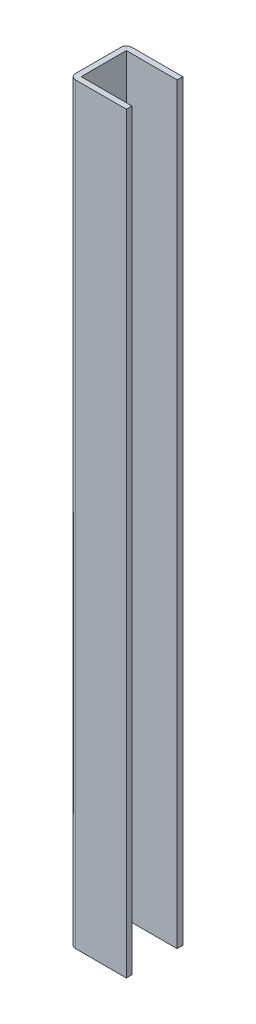
ISO-10303-21;
HEADER;
FILE_DESCRIPTION(('STEP AP214'),'2;1');
FILE_NAME('part.step','',(''),(''),'','','');
FILE_SCHEMA(('AUTOMOTIVE_DESIGN { 1 0 10303 214 1 1 1 1 }'));
ENDSEC;
DATA;
#1=APPLICATION_CONTEXT('core data for automotive mechanical design processes');
#2=APPLICATION_PROTOCOL_DEFINITION('international standard','automotive_design',2000,#1);
#3=PRODUCT_CONTEXT('',#1,'mechanical');
#4=PRODUCT('Part','Part','',(#3));
#5=PRODUCT_RELATED_PRODUCT_CATEGORY('part','',(#4));
#6=PRODUCT_DEFINITION_FORMATION('','',#4);
#7=PRODUCT_DEFINITION_CONTEXT('part definition',#1,'design');
#8=PRODUCT_DEFINITION('design','',#6,#7);
#9=PRODUCT_DEFINITION_SHAPE('','',#8);
#10=(LENGTH_UNIT() NAMED_UNIT(*) SI_UNIT(.MILLI.,.METRE.));
#11=(NAMED_UNIT(*) PLANE_ANGLE_UNIT() SI_UNIT($,.RADIAN.));
#12=(NAMED_UNIT(*) SI_UNIT($,.STERADIAN.) SOLID_ANGLE_UNIT());
#13=UNCERTAINTY_MEASURE_WITH_UNIT(LENGTH_MEASURE(1.E-05),#10,'distance_accuracy_value','');
#14=(GEOMETRIC_REPRESENTATION_CONTEXT(3) GLOBAL_UNCERTAINTY_ASSIGNED_CONTEXT((#13)) GLOBAL_UNIT_ASSIGNED_CONTEXT((#10,
#11,#12)) REPRESENTATION_CONTEXT('',''));
#15=CARTESIAN_POINT('',(0.,0.,0.));
#16=DIRECTION('',(0.,0.,1.));
#17=DIRECTION('',(1.,0.,0.));
#18=AXIS2_PLACEMENT_3D('',#15,#16,#17);
#19=CARTESIAN_POINT('',(-37.,400.,-12.));
#20=DIRECTION('',(0.,1.,0.));
#21=DIRECTION('',(0.,0.,1.));
#22=AXIS2_PLACEMENT_3D('',#19,#20,#21);
#23=PLANE('',#22);
#24=DIRECTION('',(0.,0.,1.));
#25=VECTOR('',#24,1.);
#26=CARTESIAN_POINT('',(-10.,400.,23.0622512959863));
#27=LINE('',#26,#25);
#28=CARTESIAN_POINT('',(-10.,400.,-15.));
#29=VERTEX_POINT('',#28);
#30=CARTESIAN_POINT('',(-10.,400.,-12.));
#31=VERTEX_POINT('',#30);
#32=EDGE_CURVE('E94',#29,#31,#27,.T.);
#33=ORIENTED_EDGE('',*,*,#32,.F.);
#34=DIRECTION('',(-1.,0.,0.));
#35=VECTOR('',#34,1.);
#36=CARTESIAN_POINT('',(-37.,400.,-15.));
#37=LINE('',#36,#35);
#38=CARTESIAN_POINT('',(-37.,400.,-15.));
#39=VERTEX_POINT('',#38);
#40=EDGE_CURVE('E159',#29,#39,#37,.T.);
#41=ORIENTED_EDGE('',*,*,#40,.T.);
#42=CARTESIAN_POINT('',(-37.,400.,-12.));
#43=DIRECTION('',(0.,1.,0.));
#44=DIRECTION('',(0.,0.,1.));
#45=AXIS2_PLACEMENT_3D('',#42,#43,#44);
#46=CIRCLE('',#45,3.);
#47=CARTESIAN_POINT('',(-40.,400.,-12.));
#48=VERTEX_POINT('',#47);
#49=EDGE_CURVE('E190',#39,#48,#46,.T.);
#50=ORIENTED_EDGE('',*,*,#49,.T.);
#51=DIRECTION('',(0.,0.,1.));
#52=VECTOR('',#51,1.);
#53=CARTESIAN_POINT('',(-40.,400.,-12.));
#54=LINE('',#53,#52);
#55=CARTESIAN_POINT('',(-40.,400.,12.));
#56=VERTEX_POINT('',#55);
#57=EDGE_CURVE('E201',#48,#56,#54,.T.);
#58=ORIENTED_EDGE('',*,*,#57,.T.);
#59=CARTESIAN_POINT('',(-37.,400.,12.));
#60=DIRECTION('',(0.,1.,0.));
#61=DIRECTION('',(0.,0.,1.));
#62=AXIS2_PLACEMENT_3D('',#59,#60,#61);
#63=CIRCLE('',#62,3.);
#64=CARTESIAN_POINT('',(-37.,400.,15.));
#65=VERTEX_POINT('',#64);
#66=EDGE_CURVE('E174',#56,#65,#63,.T.);
#67=ORIENTED_EDGE('',*,*,#66,.T.);
#68=DIRECTION('',(1.,0.,0.));
#69=VECTOR('',#68,1.);
#70=CARTESIAN_POINT('',(-37.,400.,15.));
#71=LINE('',#70,#69);
#72=CARTESIAN_POINT('',(-10.,400.,15.));
#73=VERTEX_POINT('',#72);
#74=EDGE_CURVE('E169',#65,#73,#71,.T.);
#75=ORIENTED_EDGE('',*,*,#74,.T.);
#76=CARTESIAN_POINT('',(-10.,400.,12.));
#77=VERTEX_POINT('',#76);
#78=EDGE_CURVE('E163',#77,#73,#27,.T.);
#79=ORIENTED_EDGE('',*,*,#78,.F.);
#80=DIRECTION('',(1.,0.,0.));
#81=VECTOR('',#80,1.);
#82=CARTESIAN_POINT('',(-37.,400.,12.));
#83=LINE('',#82,#81);
#84=CARTESIAN_POINT('',(-37.,400.,12.));
#85=VERTEX_POINT('',#84);
#86=EDGE_CURVE('E237',#85,#77,#83,.T.);
#87=ORIENTED_EDGE('',*,*,#86,.F.);
#88=DIRECTION('',(0.,0.,1.));
#89=VECTOR('',#88,1.);
#90=CARTESIAN_POINT('',(-37.,400.,-12.));
#91=LINE('',#90,#89);
#92=CARTESIAN_POINT('',(-37.,400.,-12.));
#93=VERTEX_POINT('',#92);
#94=EDGE_CURVE('E229',#93,#85,#91,.T.);
#95=ORIENTED_EDGE('',*,*,#94,.F.);
#96=DIRECTION('',(-1.,0.,0.));
#97=VECTOR('',#96,1.);
#98=CARTESIAN_POINT('',(-37.,400.,-12.));
#99=LINE('',#98,#97);
#100=EDGE_CURVE('E162',#31,#93,#99,.T.);
#101=ORIENTED_EDGE('',*,*,#100,.F.);
#102=EDGE_LOOP('',(#33,#41,#50,#58,#67,#75,#79,#87,#95,#101));
#103=FACE_BOUND('',#102,.T.);
#104=ADVANCED_FACE('F72',(#103),#23,.T.);
#105=CARTESIAN_POINT('',(-37.,0.,-12.));
#106=DIRECTION('',(0.,1.,0.));
#107=DIRECTION('',(0.,0.,1.));
#108=AXIS2_PLACEMENT_3D('',#105,#106,#107);
#109=PLANE('',#108);
#110=DIRECTION('',(-1.,0.,0.));
#111=VECTOR('',#110,1.);
#112=CARTESIAN_POINT('',(-37.,0.,-15.));
#113=LINE('',#112,#111);
#114=CARTESIAN_POINT('',(-10.,0.,-15.));
#115=VERTEX_POINT('',#114);
#116=CARTESIAN_POINT('',(-37.,0.,-15.));
#117=VERTEX_POINT('',#116);
#118=EDGE_CURVE('E189',#115,#117,#113,.T.);
#119=ORIENTED_EDGE('',*,*,#118,.F.);
#120=DIRECTION('',(0.,0.,1.));
#121=VECTOR('',#120,1.);
#122=CARTESIAN_POINT('',(-10.,0.,23.0622512959863));
#123=LINE('',#122,#121);
#124=CARTESIAN_POINT('',(-10.,0.,-12.));
#125=VERTEX_POINT('',#124);
#126=EDGE_CURVE('E149',#115,#125,#123,.T.);
#127=ORIENTED_EDGE('',*,*,#126,.T.);
#128=DIRECTION('',(-1.,0.,0.));
#129=VECTOR('',#128,1.);
#130=CARTESIAN_POINT('',(-37.,0.,-12.));
#131=LINE('',#130,#129);
#132=CARTESIAN_POINT('',(-37.,0.,-12.));
#133=VERTEX_POINT('',#132);
#134=EDGE_CURVE('E227',#125,#133,#131,.T.);
#135=ORIENTED_EDGE('',*,*,#134,.T.);
#136=DIRECTION('',(0.,0.,1.));
#137=VECTOR('',#136,1.);
#138=CARTESIAN_POINT('',(-37.,0.,-12.));
#139=LINE('',#138,#137);
#140=CARTESIAN_POINT('',(-37.,0.,12.));
#141=VERTEX_POINT('',#140);
#142=EDGE_CURVE('E233',#133,#141,#139,.T.);
#143=ORIENTED_EDGE('',*,*,#142,.T.);
#144=DIRECTION('',(1.,0.,0.));
#145=VECTOR('',#144,1.);
#146=CARTESIAN_POINT('',(-37.,0.,12.));
#147=LINE('',#146,#145);
#148=CARTESIAN_POINT('',(-10.,0.,12.));
#149=VERTEX_POINT('',#148);
#150=EDGE_CURVE('E230',#141,#149,#147,.T.);
#151=ORIENTED_EDGE('',*,*,#150,.T.);
#152=CARTESIAN_POINT('',(-10.,0.,15.));
#153=VERTEX_POINT('',#152);
#154=EDGE_CURVE('E87',#149,#153,#123,.T.);
#155=ORIENTED_EDGE('',*,*,#154,.T.);
#156=DIRECTION('',(1.,0.,0.));
#157=VECTOR('',#156,1.);
#158=CARTESIAN_POINT('',(-37.,0.,15.));
#159=LINE('',#158,#157);
#160=CARTESIAN_POINT('',(-37.,0.,15.));
#161=VERTEX_POINT('',#160);
#162=EDGE_CURVE('E186',#161,#153,#159,.T.);
#163=ORIENTED_EDGE('',*,*,#162,.F.);
#164=CARTESIAN_POINT('',(-37.,0.,12.));
#165=DIRECTION('',(0.,1.,0.));
#166=DIRECTION('',(0.,0.,1.));
#167=AXIS2_PLACEMENT_3D('',#164,#165,#166);
#168=CIRCLE('',#167,3.);
#169=CARTESIAN_POINT('',(-40.,0.,12.));
#170=VERTEX_POINT('',#169);
#171=EDGE_CURVE('E184',#170,#161,#168,.T.);
#172=ORIENTED_EDGE('',*,*,#171,.F.);
#173=DIRECTION('',(0.,0.,1.));
#174=VECTOR('',#173,1.);
#175=CARTESIAN_POINT('',(-40.,0.,-12.));
#176=LINE('',#175,#174);
#177=CARTESIAN_POINT('',(-40.,0.,-12.));
#178=VERTEX_POINT('',#177);
#179=EDGE_CURVE('E181',#178,#170,#176,.T.);
#180=ORIENTED_EDGE('',*,*,#179,.F.);
#181=CARTESIAN_POINT('',(-37.,0.,-12.));
#182=DIRECTION('',(0.,1.,0.));
#183=DIRECTION('',(0.,0.,1.));
#184=AXIS2_PLACEMENT_3D('',#181,#182,#183);
#185=CIRCLE('',#184,3.);
#186=EDGE_CURVE('E178',#117,#178,#185,.T.);
#187=ORIENTED_EDGE('',*,*,#186,.F.);
#188=EDGE_LOOP('',(#119,#127,#135,#143,#151,#155,#163,#172,#180,#187));
#189=FACE_BOUND('',#188,.T.);
#190=ADVANCED_FACE('F205',(#189),#109,.F.);
#191=CARTESIAN_POINT('',(-37.,400.,-12.));
#192=DIRECTION('',(0.,-1.,0.));
#193=DIRECTION('',(0.,0.,-1.));
#194=AXIS2_PLACEMENT_3D('',#191,#192,#193);
#195=CYLINDRICAL_SURFACE('',#194,3.);
#196=ORIENTED_EDGE('',*,*,#186,.T.);
#197=DIRECTION('',(0.,-1.,0.));
#198=VECTOR('',#197,1.);
#199=CARTESIAN_POINT('',(-40.,400.,-12.));
#200=LINE('',#199,#198);
#201=EDGE_CURVE('E80',#48,#178,#200,.T.);
#202=ORIENTED_EDGE('',*,*,#201,.F.);
#203=ORIENTED_EDGE('',*,*,#49,.F.);
#204=DIRECTION('',(0.,-1.,0.));
#205=VECTOR('',#204,1.);
#206=CARTESIAN_POINT('',(-37.,400.,-15.));
#207=LINE('',#206,#205);
#208=EDGE_CURVE('E167',#39,#117,#207,.T.);
#209=ORIENTED_EDGE('',*,*,#208,.T.);
#210=EDGE_LOOP('',(#196,#202,#203,#209));
#211=FACE_BOUND('',#210,.T.);
#212=ADVANCED_FACE('F74',(#211),#195,.T.);
#213=CARTESIAN_POINT('',(-40.,400.,-12.));
#214=DIRECTION('',(1.,0.,0.));
#215=DIRECTION('',(0.,0.,-1.));
#216=AXIS2_PLACEMENT_3D('',#213,#214,#215);
#217=PLANE('',#216);
#218=ORIENTED_EDGE('',*,*,#179,.T.);
#219=DIRECTION('',(0.,-1.,0.));
#220=VECTOR('',#219,1.);
#221=CARTESIAN_POINT('',(-40.,400.,12.));
#222=LINE('',#221,#220);
#223=EDGE_CURVE('E194',#56,#170,#222,.T.);
#224=ORIENTED_EDGE('',*,*,#223,.F.);
#225=ORIENTED_EDGE('',*,*,#57,.F.);
#226=ORIENTED_EDGE('',*,*,#201,.T.);
#227=EDGE_LOOP('',(#218,#224,#225,#226));
#228=FACE_BOUND('',#227,.T.);
#229=ADVANCED_FACE('F199',(#228),#217,.F.);
#230=CARTESIAN_POINT('',(-37.,400.,12.));
#231=DIRECTION('',(0.,-1.,0.));
#232=DIRECTION('',(0.,0.,-1.));
#233=AXIS2_PLACEMENT_3D('',#230,#231,#232);
#234=CYLINDRICAL_SURFACE('',#233,3.);
#235=ORIENTED_EDGE('',*,*,#171,.T.);
#236=DIRECTION('',(0.,-1.,0.));
#237=VECTOR('',#236,1.);
#238=CARTESIAN_POINT('',(-37.,400.,15.));
#239=LINE('',#238,#237);
#240=EDGE_CURVE('E171',#65,#161,#239,.T.);
#241=ORIENTED_EDGE('',*,*,#240,.F.);
#242=ORIENTED_EDGE('',*,*,#66,.F.);
#243=ORIENTED_EDGE('',*,*,#223,.T.);
#244=EDGE_LOOP('',(#235,#241,#242,#243));
#245=FACE_BOUND('',#244,.T.);
#246=ADVANCED_FACE('F210',(#245),#234,.T.);
#247=CARTESIAN_POINT('',(-37.,400.,15.));
#248=DIRECTION('',(0.,0.,-1.));
#249=DIRECTION('',(-1.,0.,0.));
#250=AXIS2_PLACEMENT_3D('',#247,#248,#249);
#251=PLANE('',#250);
#252=ORIENTED_EDGE('',*,*,#162,.T.);
#253=DIRECTION('',(0.,1.,0.));
#254=VECTOR('',#253,1.);
#255=CARTESIAN_POINT('',(-10.,400.,15.));
#256=LINE('',#255,#254);
#257=EDGE_CURVE('E153',#153,#73,#256,.T.);
#258=ORIENTED_EDGE('',*,*,#257,.T.);
#259=ORIENTED_EDGE('',*,*,#74,.F.);
#260=ORIENTED_EDGE('',*,*,#240,.T.);
#261=EDGE_LOOP('',(#252,#258,#259,#260));
#262=FACE_BOUND('',#261,.T.);
#263=ADVANCED_FACE('F214',(#262),#251,.F.);
#264=CARTESIAN_POINT('',(-37.,400.,-15.));
#265=DIRECTION('',(0.,0.,1.));
#266=DIRECTION('',(1.,0.,0.));
#267=AXIS2_PLACEMENT_3D('',#264,#265,#266);
#268=PLANE('',#267);
#269=ORIENTED_EDGE('',*,*,#40,.F.);
#270=DIRECTION('',(0.,-1.,0.));
#271=VECTOR('',#270,1.);
#272=CARTESIAN_POINT('',(-10.,400.,-15.));
#273=LINE('',#272,#271);
#274=EDGE_CURVE('E146',#29,#115,#273,.T.);
#275=ORIENTED_EDGE('',*,*,#274,.T.);
#276=ORIENTED_EDGE('',*,*,#118,.T.);
#277=ORIENTED_EDGE('',*,*,#208,.F.);
#278=EDGE_LOOP('',(#269,#275,#276,#277));
#279=FACE_BOUND('',#278,.T.);
#280=ADVANCED_FACE('F165',(#279),#268,.F.);
#281=CARTESIAN_POINT('',(-37.,400.,-12.));
#282=DIRECTION('',(1.,0.,0.));
#283=DIRECTION('',(0.,0.,-1.));
#284=AXIS2_PLACEMENT_3D('',#281,#282,#283);
#285=PLANE('',#284);
#286=ORIENTED_EDGE('',*,*,#142,.F.);
#287=DIRECTION('',(0.,-1.,0.));
#288=VECTOR('',#287,1.);
#289=CARTESIAN_POINT('',(-37.,400.,-12.));
#290=LINE('',#289,#288);
#291=EDGE_CURVE('E224',#93,#133,#290,.T.);
#292=ORIENTED_EDGE('',*,*,#291,.F.);
#293=ORIENTED_EDGE('',*,*,#94,.T.);
#294=DIRECTION('',(0.,-1.,0.));
#295=VECTOR('',#294,1.);
#296=CARTESIAN_POINT('',(-37.,400.,12.));
#297=LINE('',#296,#295);
#298=EDGE_CURVE('E182',#85,#141,#297,.T.);
#299=ORIENTED_EDGE('',*,*,#298,.T.);
#300=EDGE_LOOP('',(#286,#292,#293,#299));
#301=FACE_BOUND('',#300,.T.);
#302=ADVANCED_FACE('F248',(#301),#285,.T.);
#303=CARTESIAN_POINT('',(-37.,400.,12.));
#304=DIRECTION('',(0.,0.,-1.));
#305=DIRECTION('',(-1.,0.,0.));
#306=AXIS2_PLACEMENT_3D('',#303,#304,#305);
#307=PLANE('',#306);
#308=DIRECTION('',(0.,1.,0.));
#309=VECTOR('',#308,1.);
#310=CARTESIAN_POINT('',(-10.,400.,12.));
#311=LINE('',#310,#309);
#312=EDGE_CURVE('E154',#149,#77,#311,.T.);
#313=ORIENTED_EDGE('',*,*,#312,.F.);
#314=ORIENTED_EDGE('',*,*,#150,.F.);
#315=ORIENTED_EDGE('',*,*,#298,.F.);
#316=ORIENTED_EDGE('',*,*,#86,.T.);
#317=EDGE_LOOP('',(#313,#314,#315,#316));
#318=FACE_BOUND('',#317,.T.);
#319=ADVANCED_FACE('F251',(#318),#307,.T.);
#320=CARTESIAN_POINT('',(-37.,400.,-12.));
#321=DIRECTION('',(0.,0.,1.));
#322=DIRECTION('',(1.,0.,0.));
#323=AXIS2_PLACEMENT_3D('',#320,#321,#322);
#324=PLANE('',#323);
#325=DIRECTION('',(0.,-1.,0.));
#326=VECTOR('',#325,1.);
#327=CARTESIAN_POINT('',(-10.,400.,-12.));
#328=LINE('',#327,#326);
#329=EDGE_CURVE('E12',#31,#125,#328,.T.);
#330=ORIENTED_EDGE('',*,*,#329,.F.);
#331=ORIENTED_EDGE('',*,*,#100,.T.);
#332=ORIENTED_EDGE('',*,*,#291,.T.);
#333=ORIENTED_EDGE('',*,*,#134,.F.);
#334=EDGE_LOOP('',(#330,#331,#332,#333));
#335=FACE_BOUND('',#334,.T.);
#336=ADVANCED_FACE('F245',(#335),#324,.T.);
#337=CARTESIAN_POINT('',(-10.,0.,23.0622512959863));
#338=DIRECTION('',(-1.,0.,0.));
#339=DIRECTION('',(0.,0.,1.));
#340=AXIS2_PLACEMENT_3D('',#337,#338,#339);
#341=PLANE('',#340);
#342=ORIENTED_EDGE('',*,*,#32,.T.);
#343=ORIENTED_EDGE('',*,*,#329,.T.);
#344=ORIENTED_EDGE('',*,*,#126,.F.);
#345=ORIENTED_EDGE('',*,*,#274,.F.);
#346=EDGE_LOOP('',(#342,#343,#344,#345));
#347=FACE_BOUND('',#346,.T.);
#348=ADVANCED_FACE('F147',(#347),#341,.F.);
#349=ORIENTED_EDGE('',*,*,#154,.F.);
#350=ORIENTED_EDGE('',*,*,#312,.T.);
#351=ORIENTED_EDGE('',*,*,#78,.T.);
#352=ORIENTED_EDGE('',*,*,#257,.F.);
#353=EDGE_LOOP('',(#349,#350,#351,#352));
#354=FACE_BOUND('',#353,.T.);
#355=ADVANCED_FACE('F252',(#354),#341,.F.);
#356=CLOSED_SHELL('',(#104,#190,#212,#229,#246,#263,#280,#302,#319,#336,#348,#355));
#357=MANIFOLD_SOLID_BREP('B2',#356);
#358=ADVANCED_BREP_SHAPE_REPRESENTATION('',(#18,#357),#14);
#359=SHAPE_DEFINITION_REPRESENTATION(#9,#358);
ENDSEC;
END-ISO-10303-21;
